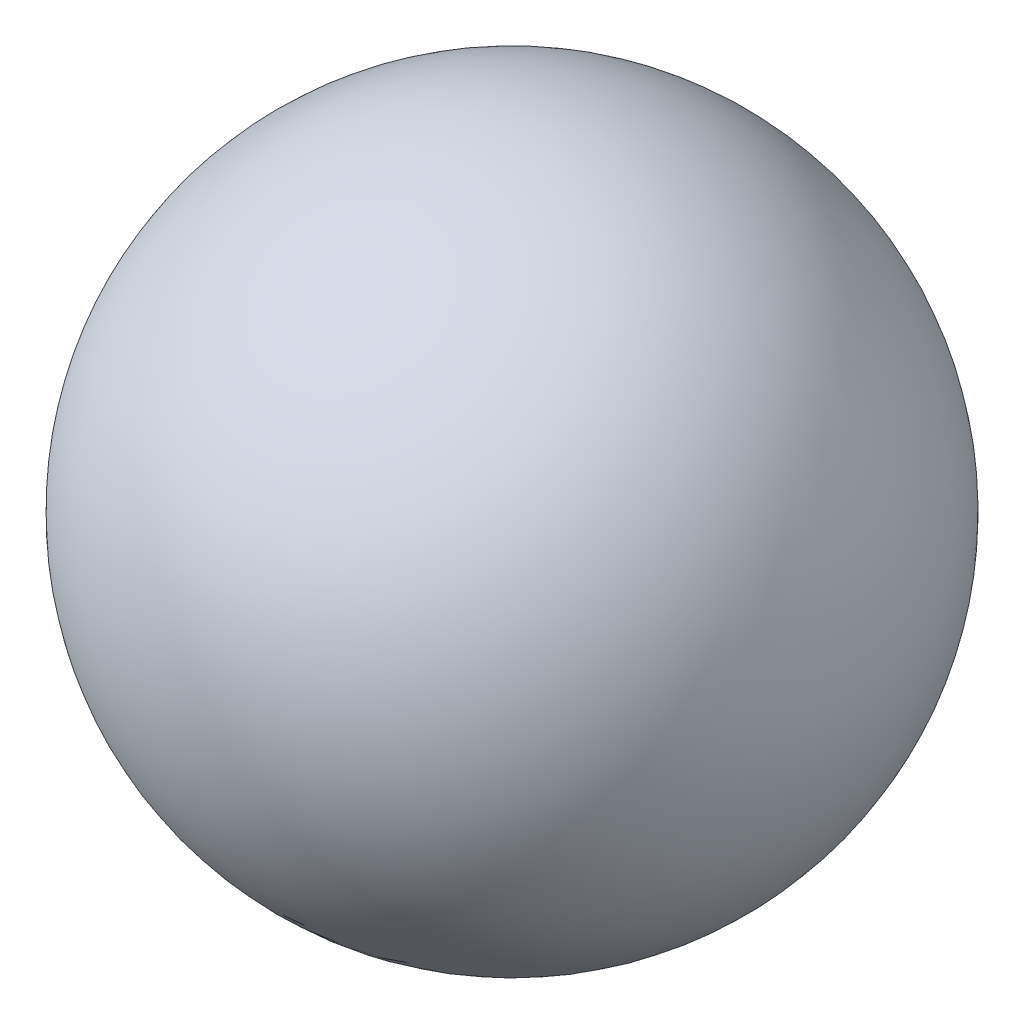
ISO-10303-21;
HEADER;
FILE_DESCRIPTION(('STEP AP214'),'2;1');
FILE_NAME('part.step','',(''),(''),'','','');
FILE_SCHEMA(('AUTOMOTIVE_DESIGN { 1 0 10303 214 1 1 1 1 }'));
ENDSEC;
DATA;
#1=APPLICATION_CONTEXT('core data for automotive mechanical design processes');
#2=APPLICATION_PROTOCOL_DEFINITION('international standard','automotive_design',2000,#1);
#3=PRODUCT_CONTEXT('',#1,'mechanical');
#4=PRODUCT('Part','Part','',(#3));
#5=PRODUCT_RELATED_PRODUCT_CATEGORY('part','',(#4));
#6=PRODUCT_DEFINITION_FORMATION('','',#4);
#7=PRODUCT_DEFINITION_CONTEXT('part definition',#1,'design');
#8=PRODUCT_DEFINITION('design','',#6,#7);
#9=PRODUCT_DEFINITION_SHAPE('','',#8);
#10=(LENGTH_UNIT() NAMED_UNIT(*) SI_UNIT(.MILLI.,.METRE.));
#11=(NAMED_UNIT(*) PLANE_ANGLE_UNIT() SI_UNIT($,.RADIAN.));
#12=(NAMED_UNIT(*) SI_UNIT($,.STERADIAN.) SOLID_ANGLE_UNIT());
#13=UNCERTAINTY_MEASURE_WITH_UNIT(LENGTH_MEASURE(1.E-05),#10,'distance_accuracy_value','');
#14=(GEOMETRIC_REPRESENTATION_CONTEXT(3) GLOBAL_UNCERTAINTY_ASSIGNED_CONTEXT((#13)) GLOBAL_UNIT_ASSIGNED_CONTEXT((#10,
#11,#12)) REPRESENTATION_CONTEXT('',''));
#15=CARTESIAN_POINT('',(0.,0.,0.));
#16=DIRECTION('',(0.,0.,1.));
#17=DIRECTION('',(1.,0.,0.));
#18=AXIS2_PLACEMENT_3D('',#15,#16,#17);
#19=CARTESIAN_POINT('',(64.16,43.3154351678161,54.2012339824724));
#20=DIRECTION('',(0.,0.624294642316075,0.781188965344138));
#21=DIRECTION('',(0.173648177666934,-0.769320949638491,0.614810203916853));
#22=AXIS2_PLACEMENT_3D('',#19,#20,#21);
#23=SPHERICAL_SURFACE('',#22,7.15);
#24=CARTESIAN_POINT('',(64.16,47.779141860376,59.786735084683));
#25=VERTEX_POINT('',#24);
#26=VERTEX_LOOP('',#25);
#27=FACE_BOUND('',#26,.T.);
#28=CARTESIAN_POINT('',(64.16,38.8517284752562,48.6157328802618));
#29=VERTEX_POINT('',#28);
#30=VERTEX_LOOP('',#29);
#31=FACE_BOUND('',#30,.T.);
#32=ADVANCED_FACE('F16',(#27,#31),#23,.T.);
#33=CLOSED_SHELL('',(#32));
#34=MANIFOLD_SOLID_BREP('B1',#33);
#35=ADVANCED_BREP_SHAPE_REPRESENTATION('',(#18,#34),#14);
#36=SHAPE_DEFINITION_REPRESENTATION(#9,#35);
ENDSEC;
END-ISO-10303-21;
